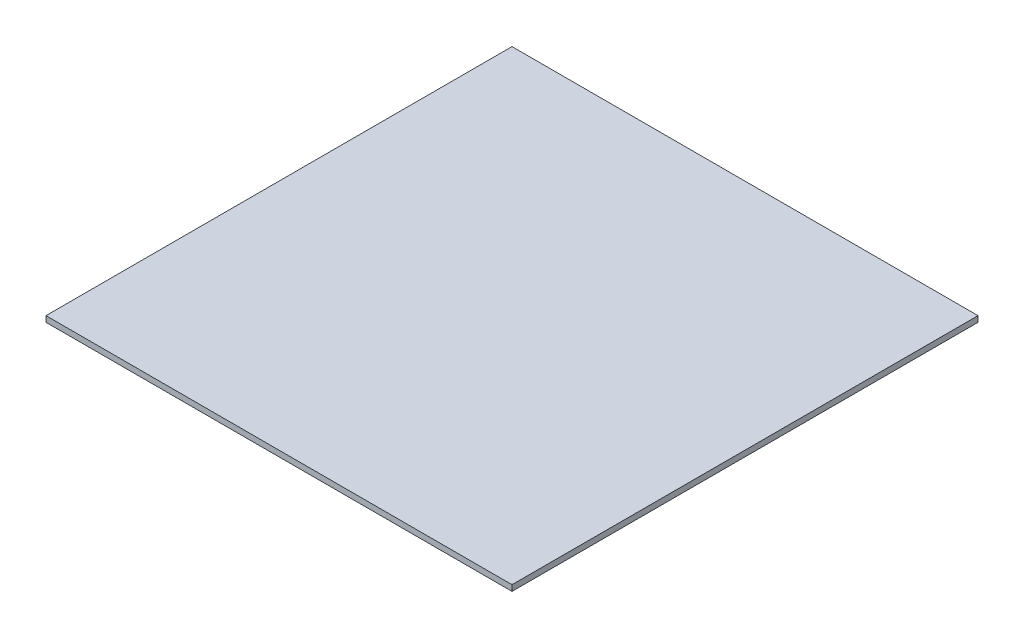
ISO-10303-21;
HEADER;
FILE_DESCRIPTION(('STEP AP214'),'2;1');
FILE_NAME('part.step','',(''),(''),'','','');
FILE_SCHEMA(('AUTOMOTIVE_DESIGN { 1 0 10303 214 1 1 1 1 }'));
ENDSEC;
DATA;
#1=APPLICATION_CONTEXT('core data for automotive mechanical design processes');
#2=APPLICATION_PROTOCOL_DEFINITION('international standard','automotive_design',2000,#1);
#3=PRODUCT_CONTEXT('',#1,'mechanical');
#4=PRODUCT('Part','Part','',(#3));
#5=PRODUCT_RELATED_PRODUCT_CATEGORY('part','',(#4));
#6=PRODUCT_DEFINITION_FORMATION('','',#4);
#7=PRODUCT_DEFINITION_CONTEXT('part definition',#1,'design');
#8=PRODUCT_DEFINITION('design','',#6,#7);
#9=PRODUCT_DEFINITION_SHAPE('','',#8);
#10=(LENGTH_UNIT() NAMED_UNIT(*) SI_UNIT(.MILLI.,.METRE.));
#11=(NAMED_UNIT(*) PLANE_ANGLE_UNIT() SI_UNIT($,.RADIAN.));
#12=(NAMED_UNIT(*) SI_UNIT($,.STERADIAN.) SOLID_ANGLE_UNIT());
#13=UNCERTAINTY_MEASURE_WITH_UNIT(LENGTH_MEASURE(1.E-05),#10,'distance_accuracy_value','');
#14=(GEOMETRIC_REPRESENTATION_CONTEXT(3) GLOBAL_UNCERTAINTY_ASSIGNED_CONTEXT((#13)) GLOBAL_UNIT_ASSIGNED_CONTEXT((#10,
#11,#12)) REPRESENTATION_CONTEXT('',''));
#15=CARTESIAN_POINT('',(0.,0.,0.));
#16=DIRECTION('',(0.,0.,1.));
#17=DIRECTION('',(1.,0.,0.));
#18=AXIS2_PLACEMENT_3D('',#15,#16,#17);
#19=CARTESIAN_POINT('',(0.,2.,0.));
#20=DIRECTION('',(-1.,0.,0.));
#21=DIRECTION('',(0.,0.,1.));
#22=AXIS2_PLACEMENT_3D('',#19,#20,#21);
#23=PLANE('',#22);
#24=DIRECTION('',(0.,0.,-1.));
#25=VECTOR('',#24,1.);
#26=CARTESIAN_POINT('',(0.,0.,0.));
#27=LINE('',#26,#25);
#28=CARTESIAN_POINT('',(0.,0.,0.));
#29=VERTEX_POINT('',#28);
#30=CARTESIAN_POINT('',(0.,0.,-160.));
#31=VERTEX_POINT('',#30);
#32=EDGE_CURVE('E100',#29,#31,#27,.T.);
#33=ORIENTED_EDGE('',*,*,#32,.T.);
#34=DIRECTION('',(0.,-1.,0.));
#35=VECTOR('',#34,1.);
#36=CARTESIAN_POINT('',(0.,2.,-160.));
#37=LINE('',#36,#35);
#38=CARTESIAN_POINT('',(0.,2.,-160.));
#39=VERTEX_POINT('',#38);
#40=EDGE_CURVE('E11',#39,#31,#37,.T.);
#41=ORIENTED_EDGE('',*,*,#40,.F.);
#42=DIRECTION('',(0.,0.,-1.));
#43=VECTOR('',#42,1.);
#44=CARTESIAN_POINT('',(0.,2.,0.));
#45=LINE('',#44,#43);
#46=CARTESIAN_POINT('',(0.,2.,0.));
#47=VERTEX_POINT('',#46);
#48=EDGE_CURVE('E88',#47,#39,#45,.T.);
#49=ORIENTED_EDGE('',*,*,#48,.F.);
#50=DIRECTION('',(0.,-1.,0.));
#51=VECTOR('',#50,1.);
#52=CARTESIAN_POINT('',(0.,2.,0.));
#53=LINE('',#52,#51);
#54=EDGE_CURVE('E96',#47,#29,#53,.T.);
#55=ORIENTED_EDGE('',*,*,#54,.T.);
#56=EDGE_LOOP('',(#33,#41,#49,#55));
#57=FACE_BOUND('',#56,.T.);
#58=ADVANCED_FACE('F37',(#57),#23,.F.);
#59=CARTESIAN_POINT('',(0.,2.,-160.));
#60=DIRECTION('',(0.,0.,1.));
#61=DIRECTION('',(1.,0.,0.));
#62=AXIS2_PLACEMENT_3D('',#59,#60,#61);
#63=PLANE('',#62);
#64=DIRECTION('',(-1.,0.,0.));
#65=VECTOR('',#64,1.);
#66=CARTESIAN_POINT('',(0.,0.,-160.));
#67=LINE('',#66,#65);
#68=CARTESIAN_POINT('',(-160.,0.,-160.));
#69=VERTEX_POINT('',#68);
#70=EDGE_CURVE('E92',#31,#69,#67,.T.);
#71=ORIENTED_EDGE('',*,*,#70,.T.);
#72=DIRECTION('',(0.,-1.,0.));
#73=VECTOR('',#72,1.);
#74=CARTESIAN_POINT('',(-160.,2.,-160.));
#75=LINE('',#74,#73);
#76=CARTESIAN_POINT('',(-160.,2.,-160.));
#77=VERTEX_POINT('',#76);
#78=EDGE_CURVE('E45',#77,#69,#75,.T.);
#79=ORIENTED_EDGE('',*,*,#78,.F.);
#80=DIRECTION('',(-1.,0.,0.));
#81=VECTOR('',#80,1.);
#82=CARTESIAN_POINT('',(0.,2.,-160.));
#83=LINE('',#82,#81);
#84=EDGE_CURVE('E83',#39,#77,#83,.T.);
#85=ORIENTED_EDGE('',*,*,#84,.F.);
#86=ORIENTED_EDGE('',*,*,#40,.T.);
#87=EDGE_LOOP('',(#71,#79,#85,#86));
#88=FACE_BOUND('',#87,.T.);
#89=ADVANCED_FACE('F91',(#88),#63,.F.);
#90=CARTESIAN_POINT('',(-160.,2.,0.));
#91=DIRECTION('',(1.,0.,0.));
#92=DIRECTION('',(0.,0.,-1.));
#93=AXIS2_PLACEMENT_3D('',#90,#91,#92);
#94=PLANE('',#93);
#95=DIRECTION('',(0.,0.,1.));
#96=VECTOR('',#95,1.);
#97=CARTESIAN_POINT('',(-160.,0.,0.));
#98=LINE('',#97,#96);
#99=CARTESIAN_POINT('',(-160.,0.,0.));
#100=VERTEX_POINT('',#99);
#101=EDGE_CURVE('E70',#69,#100,#98,.T.);
#102=ORIENTED_EDGE('',*,*,#101,.T.);
#103=DIRECTION('',(0.,-1.,0.));
#104=VECTOR('',#103,1.);
#105=CARTESIAN_POINT('',(-160.,2.,0.));
#106=LINE('',#105,#104);
#107=CARTESIAN_POINT('',(-160.,2.,0.));
#108=VERTEX_POINT('',#107);
#109=EDGE_CURVE('E93',#108,#100,#106,.T.);
#110=ORIENTED_EDGE('',*,*,#109,.F.);
#111=DIRECTION('',(0.,0.,1.));
#112=VECTOR('',#111,1.);
#113=CARTESIAN_POINT('',(-160.,2.,0.));
#114=LINE('',#113,#112);
#115=EDGE_CURVE('E86',#77,#108,#114,.T.);
#116=ORIENTED_EDGE('',*,*,#115,.F.);
#117=ORIENTED_EDGE('',*,*,#78,.T.);
#118=EDGE_LOOP('',(#102,#110,#116,#117));
#119=FACE_BOUND('',#118,.T.);
#120=ADVANCED_FACE('F94',(#119),#94,.F.);
#121=CARTESIAN_POINT('',(0.,2.,0.));
#122=DIRECTION('',(0.,0.,-1.));
#123=DIRECTION('',(-1.,0.,0.));
#124=AXIS2_PLACEMENT_3D('',#121,#122,#123);
#125=PLANE('',#124);
#126=DIRECTION('',(1.,0.,0.));
#127=VECTOR('',#126,1.);
#128=CARTESIAN_POINT('',(0.,0.,0.));
#129=LINE('',#128,#127);
#130=EDGE_CURVE('E76',#100,#29,#129,.T.);
#131=ORIENTED_EDGE('',*,*,#130,.T.);
#132=ORIENTED_EDGE('',*,*,#54,.F.);
#133=DIRECTION('',(1.,0.,0.));
#134=VECTOR('',#133,1.);
#135=CARTESIAN_POINT('',(0.,2.,0.));
#136=LINE('',#135,#134);
#137=EDGE_CURVE('E53',#108,#47,#136,.T.);
#138=ORIENTED_EDGE('',*,*,#137,.F.);
#139=ORIENTED_EDGE('',*,*,#109,.T.);
#140=EDGE_LOOP('',(#131,#132,#138,#139));
#141=FACE_BOUND('',#140,.T.);
#142=ADVANCED_FACE('F107',(#141),#125,.F.);
#143=CARTESIAN_POINT('',(0.,2.,0.));
#144=DIRECTION('',(0.,1.,0.));
#145=DIRECTION('',(0.,0.,1.));
#146=AXIS2_PLACEMENT_3D('',#143,#144,#145);
#147=PLANE('',#146);
#148=ORIENTED_EDGE('',*,*,#48,.T.);
#149=ORIENTED_EDGE('',*,*,#84,.T.);
#150=ORIENTED_EDGE('',*,*,#115,.T.);
#151=ORIENTED_EDGE('',*,*,#137,.T.);
#152=EDGE_LOOP('',(#148,#149,#150,#151));
#153=FACE_BOUND('',#152,.T.);
#154=ADVANCED_FACE('F84',(#153),#147,.T.);
#155=CARTESIAN_POINT('',(0.,0.,0.));
#156=DIRECTION('',(0.,1.,0.));
#157=DIRECTION('',(0.,0.,1.));
#158=AXIS2_PLACEMENT_3D('',#155,#156,#157);
#159=PLANE('',#158);
#160=ORIENTED_EDGE('',*,*,#32,.F.);
#161=ORIENTED_EDGE('',*,*,#130,.F.);
#162=ORIENTED_EDGE('',*,*,#101,.F.);
#163=ORIENTED_EDGE('',*,*,#70,.F.);
#164=EDGE_LOOP('',(#160,#161,#162,#163));
#165=FACE_BOUND('',#164,.T.);
#166=ADVANCED_FACE('F110',(#165),#159,.F.);
#167=CLOSED_SHELL('',(#58,#89,#120,#142,#154,#166));
#168=MANIFOLD_SOLID_BREP('B2',#167);
#169=ADVANCED_BREP_SHAPE_REPRESENTATION('',(#18,#168),#14);
#170=SHAPE_DEFINITION_REPRESENTATION(#9,#169);
ENDSEC;
END-ISO-10303-21;
